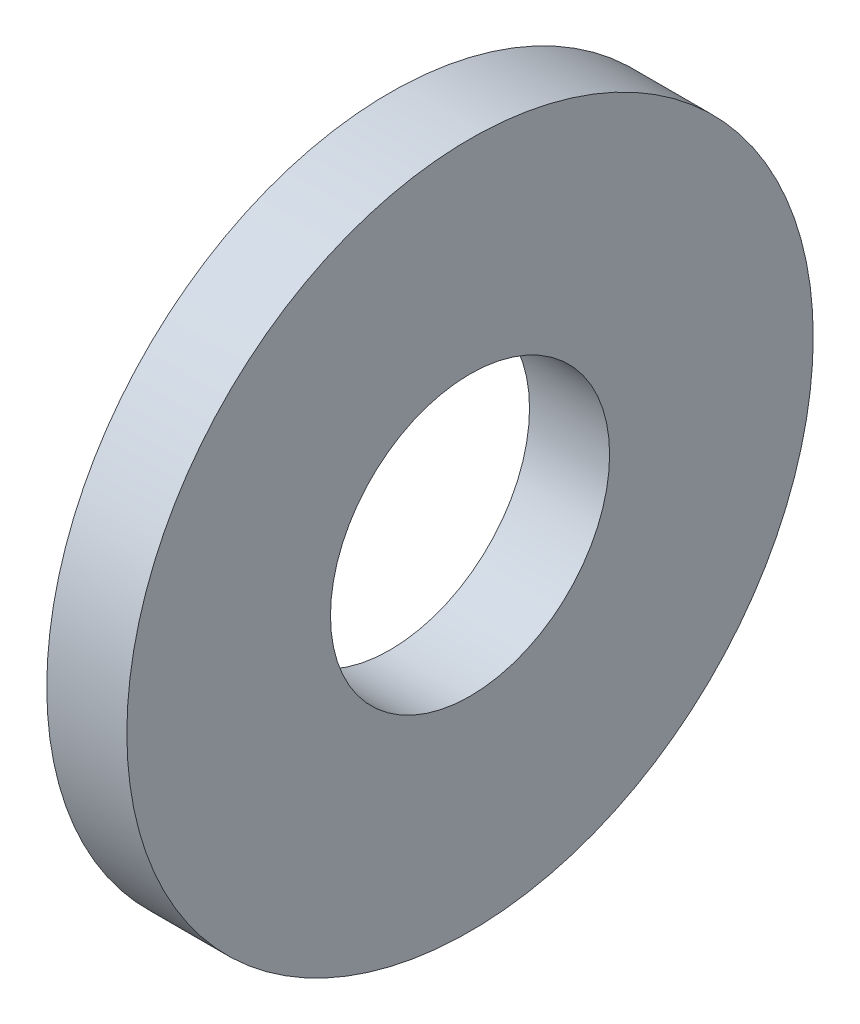
ISO-10303-21;
HEADER;
FILE_DESCRIPTION(('STEP AP214'),'2;1');
FILE_NAME('part.step','',(''),(''),'','','');
FILE_SCHEMA(('AUTOMOTIVE_DESIGN { 1 0 10303 214 1 1 1 1 }'));
ENDSEC;
DATA;
#1=APPLICATION_CONTEXT('core data for automotive mechanical design processes');
#2=APPLICATION_PROTOCOL_DEFINITION('international standard','automotive_design',2000,#1);
#3=PRODUCT_CONTEXT('',#1,'mechanical');
#4=PRODUCT('Part','Part','',(#3));
#5=PRODUCT_RELATED_PRODUCT_CATEGORY('part','',(#4));
#6=PRODUCT_DEFINITION_FORMATION('','',#4);
#7=PRODUCT_DEFINITION_CONTEXT('part definition',#1,'design');
#8=PRODUCT_DEFINITION('design','',#6,#7);
#9=PRODUCT_DEFINITION_SHAPE('','',#8);
#10=(LENGTH_UNIT() NAMED_UNIT(*) SI_UNIT(.MILLI.,.METRE.));
#11=(NAMED_UNIT(*) PLANE_ANGLE_UNIT() SI_UNIT($,.RADIAN.));
#12=(NAMED_UNIT(*) SI_UNIT($,.STERADIAN.) SOLID_ANGLE_UNIT());
#13=UNCERTAINTY_MEASURE_WITH_UNIT(LENGTH_MEASURE(1.E-05),#10,'distance_accuracy_value','');
#14=(GEOMETRIC_REPRESENTATION_CONTEXT(3) GLOBAL_UNCERTAINTY_ASSIGNED_CONTEXT((#13)) GLOBAL_UNIT_ASSIGNED_CONTEXT((#10,
#11,#12)) REPRESENTATION_CONTEXT('',''));
#15=CARTESIAN_POINT('',(0.,0.,0.));
#16=DIRECTION('',(0.,0.,1.));
#17=DIRECTION('',(1.,0.,0.));
#18=AXIS2_PLACEMENT_3D('',#15,#16,#17);
#19=CARTESIAN_POINT('',(-34.9249999999999,0.,0.));
#20=DIRECTION('',(-1.,0.,0.));
#21=DIRECTION('',(0.,0.,1.));
#22=AXIS2_PLACEMENT_3D('',#19,#20,#21);
#23=CYLINDRICAL_SURFACE('',#22,2.44);
#24=CARTESIAN_POINT('',(0.,0.,0.));
#25=DIRECTION('',(-1.,0.,0.));
#26=DIRECTION('',(0.,0.,1.));
#27=AXIS2_PLACEMENT_3D('',#24,#25,#26);
#28=CIRCLE('',#27,2.44);
#29=CARTESIAN_POINT('',(0.,0.,2.44));
#30=VERTEX_POINT('',#29);
#31=EDGE_CURVE('E10',#30,#30,#28,.T.);
#32=ORIENTED_EDGE('',*,*,#31,.F.);
#33=EDGE_LOOP('',(#32));
#34=FACE_BOUND('',#33,.T.);
#35=CARTESIAN_POINT('',(-1.4,0.,0.));
#36=DIRECTION('',(-1.,0.,0.));
#37=DIRECTION('',(0.,0.,1.));
#38=AXIS2_PLACEMENT_3D('',#35,#36,#37);
#39=CIRCLE('',#38,2.44);
#40=CARTESIAN_POINT('',(-1.4,0.,2.44));
#41=VERTEX_POINT('',#40);
#42=EDGE_CURVE('E47',#41,#41,#39,.T.);
#43=ORIENTED_EDGE('',*,*,#42,.T.);
#44=EDGE_LOOP('',(#43));
#45=FACE_BOUND('',#44,.T.);
#46=ADVANCED_FACE('F33',(#34,#45),#23,.F.);
#47=CARTESIAN_POINT('',(0.,2.44,0.));
#48=DIRECTION('',(-1.,0.,0.));
#49=DIRECTION('',(0.,0.,1.));
#50=AXIS2_PLACEMENT_3D('',#47,#48,#49);
#51=PLANE('',#50);
#52=CARTESIAN_POINT('',(0.,0.,0.));
#53=DIRECTION('',(-1.,0.,0.));
#54=DIRECTION('',(0.,0.,1.));
#55=AXIS2_PLACEMENT_3D('',#52,#53,#54);
#56=CIRCLE('',#55,6.);
#57=CARTESIAN_POINT('',(0.,0.,6.));
#58=VERTEX_POINT('',#57);
#59=EDGE_CURVE('E39',#58,#58,#56,.T.);
#60=ORIENTED_EDGE('',*,*,#59,.F.);
#61=EDGE_LOOP('',(#60));
#62=FACE_BOUND('',#61,.T.);
#63=ORIENTED_EDGE('',*,*,#31,.T.);
#64=EDGE_LOOP('',(#63));
#65=FACE_BOUND('',#64,.T.);
#66=ADVANCED_FACE('F62',(#62,#65),#51,.F.);
#67=CARTESIAN_POINT('',(-34.9249999999999,0.,0.));
#68=DIRECTION('',(-1.,0.,0.));
#69=DIRECTION('',(0.,0.,1.));
#70=AXIS2_PLACEMENT_3D('',#67,#68,#69);
#71=CYLINDRICAL_SURFACE('',#70,6.);
#72=CARTESIAN_POINT('',(-1.4,0.,0.));
#73=DIRECTION('',(-1.,0.,0.));
#74=DIRECTION('',(0.,0.,1.));
#75=AXIS2_PLACEMENT_3D('',#72,#73,#74);
#76=CIRCLE('',#75,6.);
#77=CARTESIAN_POINT('',(-1.4,0.,6.));
#78=VERTEX_POINT('',#77);
#79=EDGE_CURVE('E43',#78,#78,#76,.T.);
#80=ORIENTED_EDGE('',*,*,#79,.F.);
#81=EDGE_LOOP('',(#80));
#82=FACE_BOUND('',#81,.T.);
#83=ORIENTED_EDGE('',*,*,#59,.T.);
#84=EDGE_LOOP('',(#83));
#85=FACE_BOUND('',#84,.T.);
#86=ADVANCED_FACE('F57',(#82,#85),#71,.T.);
#87=CARTESIAN_POINT('',(-1.4,6.,0.));
#88=DIRECTION('',(1.,0.,0.));
#89=DIRECTION('',(0.,0.,-1.));
#90=AXIS2_PLACEMENT_3D('',#87,#88,#89);
#91=PLANE('',#90);
#92=ORIENTED_EDGE('',*,*,#42,.F.);
#93=EDGE_LOOP('',(#92));
#94=FACE_BOUND('',#93,.T.);
#95=ORIENTED_EDGE('',*,*,#79,.T.);
#96=EDGE_LOOP('',(#95));
#97=FACE_BOUND('',#96,.T.);
#98=ADVANCED_FACE('F54',(#94,#97),#91,.F.);
#99=CLOSED_SHELL('',(#46,#66,#86,#98));
#100=MANIFOLD_SOLID_BREP('B2',#99);
#101=ADVANCED_BREP_SHAPE_REPRESENTATION('',(#18,#100),#14);
#102=SHAPE_DEFINITION_REPRESENTATION(#9,#101);
ENDSEC;
END-ISO-10303-21;
